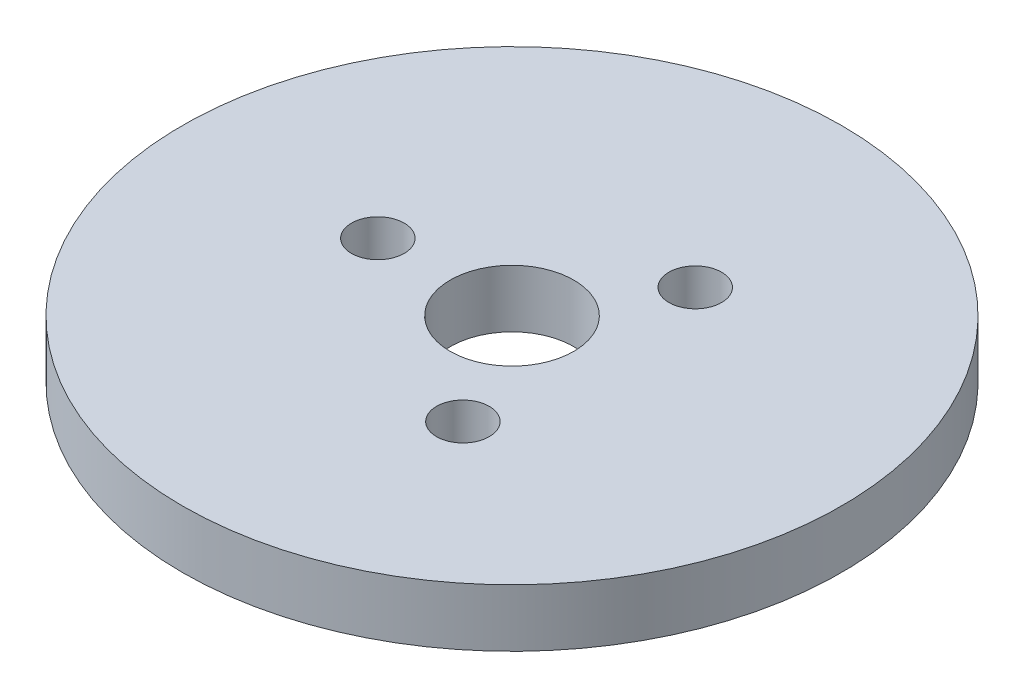
ISO-10303-21;
HEADER;
FILE_DESCRIPTION(('STEP AP214'),'2;1');
FILE_NAME('part.step','',(''),(''),'','','');
FILE_SCHEMA(('AUTOMOTIVE_DESIGN { 1 0 10303 214 1 1 1 1 }'));
ENDSEC;
DATA;
#1=APPLICATION_CONTEXT('core data for automotive mechanical design processes');
#2=APPLICATION_PROTOCOL_DEFINITION('international standard','automotive_design',2000,#1);
#3=PRODUCT_CONTEXT('',#1,'mechanical');
#4=PRODUCT('Part','Part','',(#3));
#5=PRODUCT_RELATED_PRODUCT_CATEGORY('part','',(#4));
#6=PRODUCT_DEFINITION_FORMATION('','',#4);
#7=PRODUCT_DEFINITION_CONTEXT('part definition',#1,'design');
#8=PRODUCT_DEFINITION('design','',#6,#7);
#9=PRODUCT_DEFINITION_SHAPE('','',#8);
#10=(LENGTH_UNIT() NAMED_UNIT(*) SI_UNIT(.MILLI.,.METRE.));
#11=(NAMED_UNIT(*) PLANE_ANGLE_UNIT() SI_UNIT($,.RADIAN.));
#12=(NAMED_UNIT(*) SI_UNIT($,.STERADIAN.) SOLID_ANGLE_UNIT());
#13=UNCERTAINTY_MEASURE_WITH_UNIT(LENGTH_MEASURE(1.E-05),#10,'distance_accuracy_value','');
#14=(GEOMETRIC_REPRESENTATION_CONTEXT(3) GLOBAL_UNCERTAINTY_ASSIGNED_CONTEXT((#13)) GLOBAL_UNIT_ASSIGNED_CONTEXT((#10,
#11,#12)) REPRESENTATION_CONTEXT('',''));
#15=CARTESIAN_POINT('',(0.,0.,0.));
#16=DIRECTION('',(0.,0.,1.));
#17=DIRECTION('',(1.,0.,0.));
#18=AXIS2_PLACEMENT_3D('',#15,#16,#17);
#19=CARTESIAN_POINT('',(0.,14.,0.));
#20=DIRECTION('',(0.,-1.,0.));
#21=DIRECTION('',(0.,0.,-1.));
#22=AXIS2_PLACEMENT_3D('',#19,#20,#21);
#23=CYLINDRICAL_SURFACE('',#22,80.);
#24=CARTESIAN_POINT('',(0.,14.,0.));
#25=DIRECTION('',(0.,1.,0.));
#26=DIRECTION('',(0.,0.,1.));
#27=AXIS2_PLACEMENT_3D('',#24,#25,#26);
#28=CIRCLE('',#27,80.);
#29=CARTESIAN_POINT('',(0.,14.,80.));
#30=VERTEX_POINT('',#29);
#31=EDGE_CURVE('E10',#30,#30,#28,.T.);
#32=ORIENTED_EDGE('',*,*,#31,.F.);
#33=EDGE_LOOP('',(#32));
#34=FACE_BOUND('',#33,.T.);
#35=CARTESIAN_POINT('',(0.,0.,0.));
#36=DIRECTION('',(0.,1.,0.));
#37=DIRECTION('',(0.,0.,1.));
#38=AXIS2_PLACEMENT_3D('',#35,#36,#37);
#39=CIRCLE('',#38,80.);
#40=CARTESIAN_POINT('',(0.,0.,80.));
#41=VERTEX_POINT('',#40);
#42=EDGE_CURVE('E37',#41,#41,#39,.T.);
#43=ORIENTED_EDGE('',*,*,#42,.T.);
#44=EDGE_LOOP('',(#43));
#45=FACE_BOUND('',#44,.T.);
#46=ADVANCED_FACE('F40',(#34,#45),#23,.T.);
#47=CARTESIAN_POINT('',(0.,14.,0.));
#48=DIRECTION('',(0.,1.,0.));
#49=DIRECTION('',(0.,0.,1.));
#50=AXIS2_PLACEMENT_3D('',#47,#48,#49);
#51=PLANE('',#50);
#52=CARTESIAN_POINT('',(16.2823472058126,14.,28.2018526269443));
#53=DIRECTION('',(0.,1.,0.));
#54=DIRECTION('',(0.866025403784436,0.,-0.500000000000004));
#55=AXIS2_PLACEMENT_3D('',#52,#53,#54);
#56=CIRCLE('',#55,6.39264699282299);
#57=CARTESIAN_POINT('',(21.8185418990235,14.,25.0055291305328));
#58=VERTEX_POINT('',#57);
#59=EDGE_CURVE('E70',#58,#58,#56,.T.);
#60=ORIENTED_EDGE('',*,*,#59,.F.);
#61=EDGE_LOOP('',(#60));
#62=FACE_BOUND('',#61,.T.);
#63=CARTESIAN_POINT('',(16.2823472058122,14.,-28.2018526269445));
#64=DIRECTION('',(0.,1.,0.));
#65=DIRECTION('',(-0.866025403784443,0.,-0.499999999999992));
#66=AXIS2_PLACEMENT_3D('',#63,#64,#65);
#67=CIRCLE('',#66,6.39264699282299);
#68=CARTESIAN_POINT('',(10.7461525126013,14.,-31.398176123356));
#69=VERTEX_POINT('',#68);
#70=EDGE_CURVE('E61',#69,#69,#67,.T.);
#71=ORIENTED_EDGE('',*,*,#70,.F.);
#72=EDGE_LOOP('',(#71));
#73=FACE_BOUND('',#72,.T.);
#74=CARTESIAN_POINT('',(-32.564694411625,14.,0.));
#75=DIRECTION('',(0.,1.,0.));
#76=DIRECTION('',(0.,0.,1.));
#77=AXIS2_PLACEMENT_3D('',#74,#75,#76);
#78=CIRCLE('',#77,6.39264699282299);
#79=CARTESIAN_POINT('',(-32.564694411625,14.,6.39264699282299));
#80=VERTEX_POINT('',#79);
#81=EDGE_CURVE('E54',#80,#80,#78,.T.);
#82=ORIENTED_EDGE('',*,*,#81,.F.);
#83=EDGE_LOOP('',(#82));
#84=FACE_BOUND('',#83,.T.);
#85=CARTESIAN_POINT('',(0.,14.,0.));
#86=DIRECTION('',(0.,1.,0.));
#87=DIRECTION('',(0.,0.,1.));
#88=AXIS2_PLACEMENT_3D('',#85,#86,#87);
#89=CIRCLE('',#88,15.);
#90=CARTESIAN_POINT('',(0.,14.,15.));
#91=VERTEX_POINT('',#90);
#92=EDGE_CURVE('E50',#91,#91,#89,.T.);
#93=ORIENTED_EDGE('',*,*,#92,.F.);
#94=EDGE_LOOP('',(#93));
#95=FACE_BOUND('',#94,.T.);
#96=ORIENTED_EDGE('',*,*,#31,.T.);
#97=EDGE_LOOP('',(#96));
#98=FACE_BOUND('',#97,.T.);
#99=ADVANCED_FACE('F85',(#62,#73,#84,#95,#98),#51,.T.);
#100=CARTESIAN_POINT('',(0.,0.,0.));
#101=DIRECTION('',(0.,1.,0.));
#102=DIRECTION('',(0.,0.,1.));
#103=AXIS2_PLACEMENT_3D('',#100,#101,#102);
#104=PLANE('',#103);
#105=CARTESIAN_POINT('',(0.,0.,0.));
#106=DIRECTION('',(0.,1.,0.));
#107=DIRECTION('',(0.,0.,1.));
#108=AXIS2_PLACEMENT_3D('',#105,#106,#107);
#109=CIRCLE('',#108,15.);
#110=CARTESIAN_POINT('',(0.,0.,15.));
#111=VERTEX_POINT('',#110);
#112=EDGE_CURVE('E47',#111,#111,#109,.T.);
#113=ORIENTED_EDGE('',*,*,#112,.T.);
#114=EDGE_LOOP('',(#113));
#115=FACE_BOUND('',#114,.T.);
#116=ORIENTED_EDGE('',*,*,#42,.F.);
#117=EDGE_LOOP('',(#116));
#118=FACE_BOUND('',#117,.T.);
#119=ADVANCED_FACE('F84',(#115,#118),#104,.F.);
#120=CARTESIAN_POINT('',(0.,14.,0.));
#121=DIRECTION('',(0.,-1.,0.));
#122=DIRECTION('',(0.,0.,-1.));
#123=AXIS2_PLACEMENT_3D('',#120,#121,#122);
#124=CYLINDRICAL_SURFACE('',#123,15.);
#125=ORIENTED_EDGE('',*,*,#92,.T.);
#126=EDGE_LOOP('',(#125));
#127=FACE_BOUND('',#126,.T.);
#128=ORIENTED_EDGE('',*,*,#112,.F.);
#129=EDGE_LOOP('',(#128));
#130=FACE_BOUND('',#129,.T.);
#131=ADVANCED_FACE('F91',(#127,#130),#124,.F.);
#132=CARTESIAN_POINT('',(-32.564694411625,0.273299169719597,0.));
#133=DIRECTION('',(0.,1.,0.));
#134=DIRECTION('',(0.,0.,1.));
#135=AXIS2_PLACEMENT_3D('',#132,#133,#134);
#136=CYLINDRICAL_SURFACE('',#135,6.39264699282299);
#137=CARTESIAN_POINT('',(-32.564694411625,0.273299169719597,0.));
#138=DIRECTION('',(0.,1.,0.));
#139=DIRECTION('',(0.,0.,1.));
#140=AXIS2_PLACEMENT_3D('',#137,#138,#139);
#141=CIRCLE('',#140,6.39264699282299);
#142=CARTESIAN_POINT('',(-32.564694411625,0.273299169719597,6.39264699282299));
#143=VERTEX_POINT('',#142);
#144=EDGE_CURVE('E55',#143,#143,#141,.T.);
#145=ORIENTED_EDGE('',*,*,#144,.F.);
#146=EDGE_LOOP('',(#145));
#147=FACE_BOUND('',#146,.T.);
#148=ORIENTED_EDGE('',*,*,#81,.T.);
#149=EDGE_LOOP('',(#148));
#150=FACE_BOUND('',#149,.T.);
#151=ADVANCED_FACE('F96',(#147,#150),#136,.F.);
#152=CARTESIAN_POINT('',(-32.564694411625,0.273299169719597,0.));
#153=DIRECTION('',(0.,1.,0.));
#154=DIRECTION('',(0.,0.,1.));
#155=AXIS2_PLACEMENT_3D('',#152,#153,#154);
#156=PLANE('',#155);
#157=ORIENTED_EDGE('',*,*,#144,.T.);
#158=EDGE_LOOP('',(#157));
#159=FACE_BOUND('',#158,.T.);
#160=ADVANCED_FACE('F127',(#159),#156,.T.);
#161=CARTESIAN_POINT('',(16.2823472058122,0.273299169719597,-28.2018526269445));
#162=DIRECTION('',(0.,1.,0.));
#163=DIRECTION('',(0.,0.,1.));
#164=AXIS2_PLACEMENT_3D('',#161,#162,#163);
#165=CYLINDRICAL_SURFACE('',#164,6.39264699282299);
#166=CARTESIAN_POINT('',(16.2823472058122,0.273299169719597,-28.2018526269445));
#167=DIRECTION('',(0.,1.,0.));
#168=DIRECTION('',(-0.866025403784443,0.,-0.499999999999992));
#169=AXIS2_PLACEMENT_3D('',#166,#167,#168);
#170=CIRCLE('',#169,6.39264699282299);
#171=CARTESIAN_POINT('',(10.7461525126013,0.273299169719597,-31.398176123356));
#172=VERTEX_POINT('',#171);
#173=EDGE_CURVE('E63',#172,#172,#170,.T.);
#174=ORIENTED_EDGE('',*,*,#173,.F.);
#175=EDGE_LOOP('',(#174));
#176=FACE_BOUND('',#175,.T.);
#177=ORIENTED_EDGE('',*,*,#70,.T.);
#178=EDGE_LOOP('',(#177));
#179=FACE_BOUND('',#178,.T.);
#180=ADVANCED_FACE('F133',(#176,#179),#165,.F.);
#181=CARTESIAN_POINT('',(16.2823472058122,0.273299169719597,-28.2018526269445));
#182=DIRECTION('',(0.,1.,0.));
#183=DIRECTION('',(-0.866025403784443,0.,-0.499999999999992));
#184=AXIS2_PLACEMENT_3D('',#181,#182,#183);
#185=PLANE('',#184);
#186=ORIENTED_EDGE('',*,*,#173,.T.);
#187=EDGE_LOOP('',(#186));
#188=FACE_BOUND('',#187,.T.);
#189=ADVANCED_FACE('F77',(#188),#185,.T.);
#190=CARTESIAN_POINT('',(16.2823472058126,0.273299169719597,28.2018526269443));
#191=DIRECTION('',(0.,1.,0.));
#192=DIRECTION('',(0.,0.,1.));
#193=AXIS2_PLACEMENT_3D('',#190,#191,#192);
#194=CYLINDRICAL_SURFACE('',#193,6.39264699282299);
#195=CARTESIAN_POINT('',(16.2823472058126,0.273299169719597,28.2018526269443));
#196=DIRECTION('',(0.,1.,0.));
#197=DIRECTION('',(0.866025403784436,0.,-0.500000000000004));
#198=AXIS2_PLACEMENT_3D('',#195,#196,#197);
#199=CIRCLE('',#198,6.39264699282299);
#200=CARTESIAN_POINT('',(21.8185418990235,0.273299169719597,25.0055291305328));
#201=VERTEX_POINT('',#200);
#202=EDGE_CURVE('E59',#201,#201,#199,.T.);
#203=ORIENTED_EDGE('',*,*,#202,.F.);
#204=EDGE_LOOP('',(#203));
#205=FACE_BOUND('',#204,.T.);
#206=ORIENTED_EDGE('',*,*,#59,.T.);
#207=EDGE_LOOP('',(#206));
#208=FACE_BOUND('',#207,.T.);
#209=ADVANCED_FACE('F73',(#205,#208),#194,.F.);
#210=CARTESIAN_POINT('',(16.2823472058126,0.273299169719597,28.2018526269443));
#211=DIRECTION('',(0.,1.,0.));
#212=DIRECTION('',(0.866025403784436,0.,-0.500000000000004));
#213=AXIS2_PLACEMENT_3D('',#210,#211,#212);
#214=PLANE('',#213);
#215=ORIENTED_EDGE('',*,*,#202,.T.);
#216=EDGE_LOOP('',(#215));
#217=FACE_BOUND('',#216,.T.);
#218=ADVANCED_FACE('F71',(#217),#214,.T.);
#219=CLOSED_SHELL('',(#46,#99,#119,#131,#151,#160,#180,#189,#209,#218));
#220=MANIFOLD_SOLID_BREP('B2',#219);
#221=ADVANCED_BREP_SHAPE_REPRESENTATION('',(#18,#220),#14);
#222=SHAPE_DEFINITION_REPRESENTATION(#9,#221);
ENDSEC;
END-ISO-10303-21;
